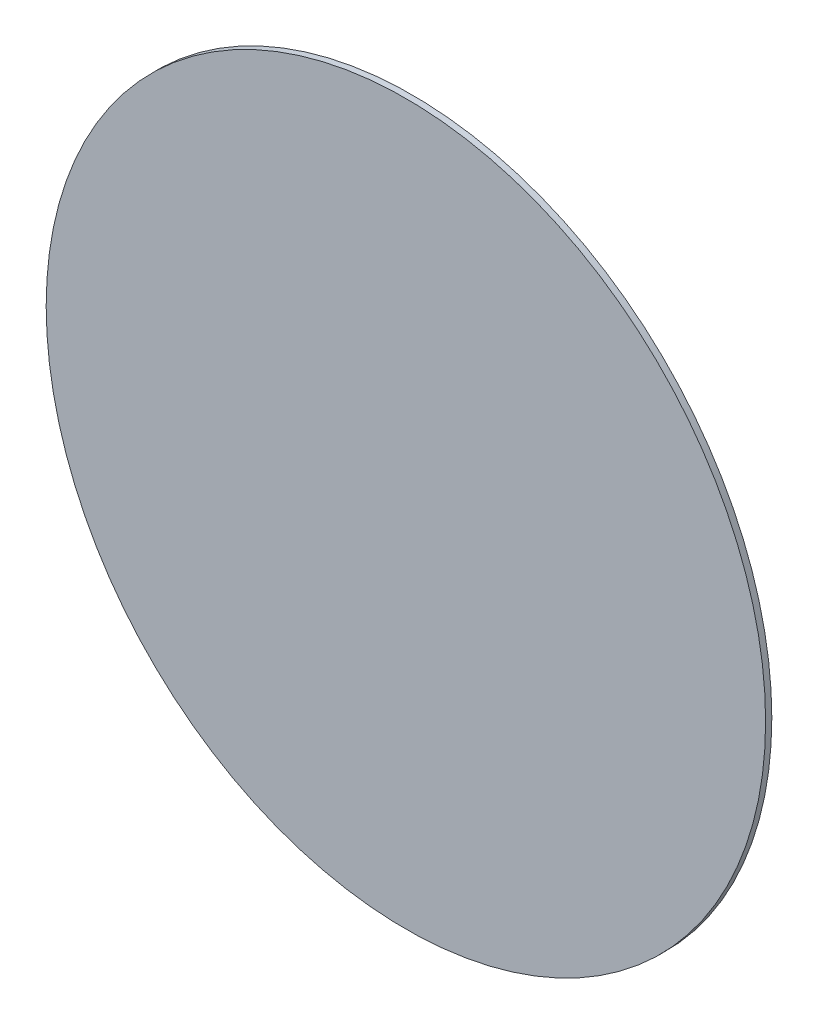
ISO-10303-21;
HEADER;
FILE_DESCRIPTION(('STEP AP214'),'2;1');
FILE_NAME('part.step','',(''),(''),'','','');
FILE_SCHEMA(('AUTOMOTIVE_DESIGN { 1 0 10303 214 1 1 1 1 }'));
ENDSEC;
DATA;
#1=APPLICATION_CONTEXT('core data for automotive mechanical design processes');
#2=APPLICATION_PROTOCOL_DEFINITION('international standard','automotive_design',2000,#1);
#3=PRODUCT_CONTEXT('',#1,'mechanical');
#4=PRODUCT('Part','Part','',(#3));
#5=PRODUCT_RELATED_PRODUCT_CATEGORY('part','',(#4));
#6=PRODUCT_DEFINITION_FORMATION('','',#4);
#7=PRODUCT_DEFINITION_CONTEXT('part definition',#1,'design');
#8=PRODUCT_DEFINITION('design','',#6,#7);
#9=PRODUCT_DEFINITION_SHAPE('','',#8);
#10=(LENGTH_UNIT() NAMED_UNIT(*) SI_UNIT(.MILLI.,.METRE.));
#11=(NAMED_UNIT(*) PLANE_ANGLE_UNIT() SI_UNIT($,.RADIAN.));
#12=(NAMED_UNIT(*) SI_UNIT($,.STERADIAN.) SOLID_ANGLE_UNIT());
#13=UNCERTAINTY_MEASURE_WITH_UNIT(LENGTH_MEASURE(1.E-05),#10,'distance_accuracy_value','');
#14=(GEOMETRIC_REPRESENTATION_CONTEXT(3) GLOBAL_UNCERTAINTY_ASSIGNED_CONTEXT((#13)) GLOBAL_UNIT_ASSIGNED_CONTEXT((#10,
#11,#12)) REPRESENTATION_CONTEXT('',''));
#15=CARTESIAN_POINT('',(0.,0.,0.));
#16=DIRECTION('',(0.,0.,1.));
#17=DIRECTION('',(1.,0.,0.));
#18=AXIS2_PLACEMENT_3D('',#15,#16,#17);
#19=CARTESIAN_POINT('',(0.,0.,1.725));
#20=DIRECTION('',(0.,0.,-1.));
#21=DIRECTION('',(-1.,0.,0.));
#22=AXIS2_PLACEMENT_3D('',#19,#20,#21);
#23=CYLINDRICAL_SURFACE('',#22,200.);
#24=CARTESIAN_POINT('',(0.,0.,1.725));
#25=DIRECTION('',(0.,0.,1.));
#26=DIRECTION('',(1.,0.,0.));
#27=AXIS2_PLACEMENT_3D('',#24,#25,#26);
#28=CIRCLE('',#27,200.);
#29=CARTESIAN_POINT('',(200.,0.,1.725));
#30=VERTEX_POINT('',#29);
#31=EDGE_CURVE('E10',#30,#30,#28,.T.);
#32=ORIENTED_EDGE('',*,*,#31,.F.);
#33=EDGE_LOOP('',(#32));
#34=FACE_BOUND('',#33,.T.);
#35=CARTESIAN_POINT('',(0.,0.,-1.725));
#36=DIRECTION('',(0.,0.,1.));
#37=DIRECTION('',(1.,0.,0.));
#38=AXIS2_PLACEMENT_3D('',#35,#36,#37);
#39=CIRCLE('',#38,200.);
#40=CARTESIAN_POINT('',(200.,0.,-1.725));
#41=VERTEX_POINT('',#40);
#42=EDGE_CURVE('E44',#41,#41,#39,.T.);
#43=ORIENTED_EDGE('',*,*,#42,.T.);
#44=EDGE_LOOP('',(#43));
#45=FACE_BOUND('',#44,.T.);
#46=ADVANCED_FACE('F41',(#34,#45),#23,.T.);
#47=CARTESIAN_POINT('',(0.,0.,1.725));
#48=DIRECTION('',(0.,0.,1.));
#49=DIRECTION('',(1.,0.,0.));
#50=AXIS2_PLACEMENT_3D('',#47,#48,#49);
#51=PLANE('',#50);
#52=ORIENTED_EDGE('',*,*,#31,.T.);
#53=EDGE_LOOP('',(#52));
#54=FACE_BOUND('',#53,.T.);
#55=ADVANCED_FACE('F58',(#54),#51,.T.);
#56=CARTESIAN_POINT('',(0.,0.,-1.725));
#57=DIRECTION('',(0.,0.,1.));
#58=DIRECTION('',(1.,0.,0.));
#59=AXIS2_PLACEMENT_3D('',#56,#57,#58);
#60=PLANE('',#59);
#61=ORIENTED_EDGE('',*,*,#42,.F.);
#62=EDGE_LOOP('',(#61));
#63=FACE_BOUND('',#62,.T.);
#64=ADVANCED_FACE('F56',(#63),#60,.F.);
#65=CLOSED_SHELL('',(#46,#55,#64));
#66=MANIFOLD_SOLID_BREP('B2',#65);
#67=ADVANCED_BREP_SHAPE_REPRESENTATION('',(#18,#66),#14);
#68=SHAPE_DEFINITION_REPRESENTATION(#9,#67);
ENDSEC;
END-ISO-10303-21;
